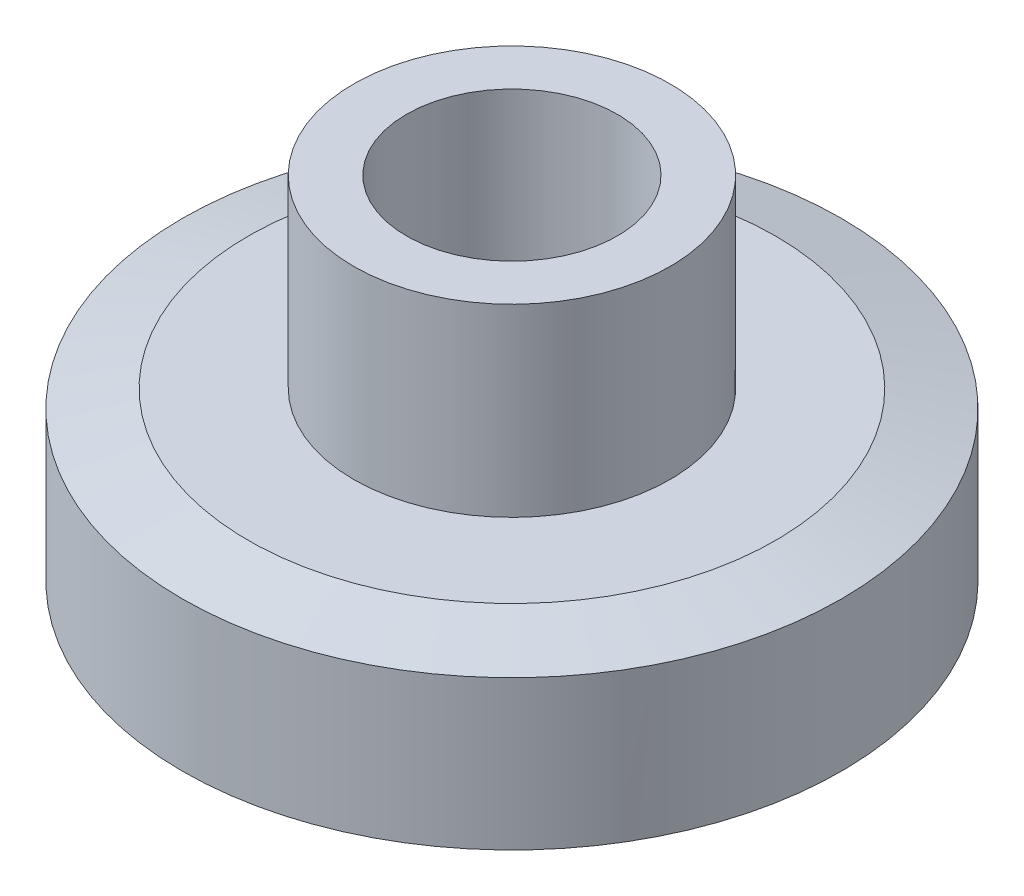
ISO-10303-21;
HEADER;
FILE_DESCRIPTION(('STEP AP214'),'2;1');
FILE_NAME('part.step','',(''),(''),'','','');
FILE_SCHEMA(('AUTOMOTIVE_DESIGN { 1 0 10303 214 1 1 1 1 }'));
ENDSEC;
DATA;
#1=APPLICATION_CONTEXT('core data for automotive mechanical design processes');
#2=APPLICATION_PROTOCOL_DEFINITION('international standard','automotive_design',2000,#1);
#3=PRODUCT_CONTEXT('',#1,'mechanical');
#4=PRODUCT('Part','Part','',(#3));
#5=PRODUCT_RELATED_PRODUCT_CATEGORY('part','',(#4));
#6=PRODUCT_DEFINITION_FORMATION('','',#4);
#7=PRODUCT_DEFINITION_CONTEXT('part definition',#1,'design');
#8=PRODUCT_DEFINITION('design','',#6,#7);
#9=PRODUCT_DEFINITION_SHAPE('','',#8);
#10=(LENGTH_UNIT() NAMED_UNIT(*) SI_UNIT(.MILLI.,.METRE.));
#11=(NAMED_UNIT(*) PLANE_ANGLE_UNIT() SI_UNIT($,.RADIAN.));
#12=(NAMED_UNIT(*) SI_UNIT($,.STERADIAN.) SOLID_ANGLE_UNIT());
#13=UNCERTAINTY_MEASURE_WITH_UNIT(LENGTH_MEASURE(1.E-05),#10,'distance_accuracy_value','');
#14=(GEOMETRIC_REPRESENTATION_CONTEXT(3) GLOBAL_UNCERTAINTY_ASSIGNED_CONTEXT((#13)) GLOBAL_UNIT_ASSIGNED_CONTEXT((#10,
#11,#12)) REPRESENTATION_CONTEXT('',''));
#15=CARTESIAN_POINT('',(0.,0.,0.));
#16=DIRECTION('',(0.,0.,1.));
#17=DIRECTION('',(1.,0.,0.));
#18=AXIS2_PLACEMENT_3D('',#15,#16,#17);
#19=CARTESIAN_POINT('',(0.,0.,0.));
#20=DIRECTION('',(0.,1.,0.));
#21=DIRECTION('',(0.,0.,1.));
#22=AXIS2_PLACEMENT_3D('',#19,#20,#21);
#23=PLANE('',#22);
#24=CARTESIAN_POINT('',(0.,0.,0.));
#25=DIRECTION('',(0.,1.,0.));
#26=DIRECTION('',(-1.,0.,0.));
#27=AXIS2_PLACEMENT_3D('',#24,#25,#26);
#28=CIRCLE('',#27,2.);
#29=CARTESIAN_POINT('',(-2.,0.,0.));
#30=VERTEX_POINT('',#29);
#31=EDGE_CURVE('E72',#30,#30,#28,.T.);
#32=ORIENTED_EDGE('',*,*,#31,.T.);
#33=EDGE_LOOP('',(#32));
#34=FACE_BOUND('',#33,.T.);
#35=CARTESIAN_POINT('',(0.,0.,0.));
#36=DIRECTION('',(0.,1.,0.));
#37=DIRECTION('',(0.,0.,1.));
#38=AXIS2_PLACEMENT_3D('',#35,#36,#37);
#39=CIRCLE('',#38,4.99999999999998);
#40=CARTESIAN_POINT('',(0.,0.,4.99999999999998));
#41=VERTEX_POINT('',#40);
#42=EDGE_CURVE('E10',#41,#41,#39,.F.);
#43=ORIENTED_EDGE('',*,*,#42,.T.);
#44=EDGE_LOOP('',(#43));
#45=FACE_BOUND('',#44,.T.);
#46=ADVANCED_FACE('F39',(#34,#45),#23,.F.);
#47=CARTESIAN_POINT('',(0.,7.,0.));
#48=DIRECTION('',(0.,1.,0.));
#49=DIRECTION('',(0.,0.,1.));
#50=AXIS2_PLACEMENT_3D('',#47,#48,#49);
#51=CYLINDRICAL_SURFACE('',#50,6.25);
#52=CARTESIAN_POINT('',(0.,0.334936490538904,0.));
#53=DIRECTION('',(0.,1.,0.));
#54=DIRECTION('',(0.,0.,1.));
#55=AXIS2_PLACEMENT_3D('',#52,#53,#54);
#56=CIRCLE('',#55,6.25);
#57=CARTESIAN_POINT('',(0.,0.334936490538904,6.25));
#58=VERTEX_POINT('',#57);
#59=EDGE_CURVE('E48',#58,#58,#56,.T.);
#60=ORIENTED_EDGE('',*,*,#59,.T.);
#61=EDGE_LOOP('',(#60));
#62=FACE_BOUND('',#61,.T.);
#63=CARTESIAN_POINT('',(0.,3.1650635094611,0.));
#64=DIRECTION('',(0.,-1.,0.));
#65=DIRECTION('',(0.,0.,-1.));
#66=AXIS2_PLACEMENT_3D('',#63,#64,#65);
#67=CIRCLE('',#66,6.25);
#68=CARTESIAN_POINT('',(0.,3.1650635094611,-6.25));
#69=VERTEX_POINT('',#68);
#70=EDGE_CURVE('E53',#69,#69,#67,.T.);
#71=ORIENTED_EDGE('',*,*,#70,.T.);
#72=EDGE_LOOP('',(#71));
#73=FACE_BOUND('',#72,.T.);
#74=ADVANCED_FACE('F103',(#62,#73),#51,.T.);
#75=CARTESIAN_POINT('',(6.25,3.5,0.));
#76=DIRECTION('',(0.,-1.,0.));
#77=DIRECTION('',(0.,0.,-1.));
#78=AXIS2_PLACEMENT_3D('',#75,#76,#77);
#79=PLANE('',#78);
#80=CARTESIAN_POINT('',(0.,3.5,0.));
#81=DIRECTION('',(0.,-1.,0.));
#82=DIRECTION('',(0.,0.,-1.));
#83=AXIS2_PLACEMENT_3D('',#80,#81,#82);
#84=CIRCLE('',#83,4.99999999999999);
#85=CARTESIAN_POINT('',(0.,3.5,-4.99999999999999));
#86=VERTEX_POINT('',#85);
#87=EDGE_CURVE('E58',#86,#86,#84,.F.);
#88=ORIENTED_EDGE('',*,*,#87,.T.);
#89=EDGE_LOOP('',(#88));
#90=FACE_BOUND('',#89,.T.);
#91=CARTESIAN_POINT('',(0.,3.5,0.));
#92=DIRECTION('',(0.,1.,0.));
#93=DIRECTION('',(0.,0.,1.));
#94=AXIS2_PLACEMENT_3D('',#91,#92,#93);
#95=CIRCLE('',#94,3.);
#96=CARTESIAN_POINT('',(0.,3.5,3.));
#97=VERTEX_POINT('',#96);
#98=EDGE_CURVE('E64',#97,#97,#95,.T.);
#99=ORIENTED_EDGE('',*,*,#98,.F.);
#100=EDGE_LOOP('',(#99));
#101=FACE_BOUND('',#100,.T.);
#102=ADVANCED_FACE('F98',(#90,#101),#79,.F.);
#103=CARTESIAN_POINT('',(0.,7.,0.));
#104=DIRECTION('',(0.,1.,0.));
#105=DIRECTION('',(0.,0.,1.));
#106=AXIS2_PLACEMENT_3D('',#103,#104,#105);
#107=CYLINDRICAL_SURFACE('',#106,3.);
#108=CARTESIAN_POINT('',(0.,7.,0.));
#109=DIRECTION('',(0.,1.,0.));
#110=DIRECTION('',(0.,0.,1.));
#111=AXIS2_PLACEMENT_3D('',#108,#109,#110);
#112=CIRCLE('',#111,3.);
#113=CARTESIAN_POINT('',(0.,7.,3.));
#114=VERTEX_POINT('',#113);
#115=EDGE_CURVE('E68',#114,#114,#112,.T.);
#116=ORIENTED_EDGE('',*,*,#115,.F.);
#117=EDGE_LOOP('',(#116));
#118=FACE_BOUND('',#117,.T.);
#119=ORIENTED_EDGE('',*,*,#98,.T.);
#120=EDGE_LOOP('',(#119));
#121=FACE_BOUND('',#120,.T.);
#122=ADVANCED_FACE('F92',(#118,#121),#107,.T.);
#123=CARTESIAN_POINT('',(3.,7.,0.));
#124=DIRECTION('',(0.,-1.,0.));
#125=DIRECTION('',(0.,0.,-1.));
#126=AXIS2_PLACEMENT_3D('',#123,#124,#125);
#127=PLANE('',#126);
#128=CARTESIAN_POINT('',(0.,7.,0.));
#129=DIRECTION('',(0.,1.,0.));
#130=DIRECTION('',(-1.,0.,0.));
#131=AXIS2_PLACEMENT_3D('',#128,#129,#130);
#132=CIRCLE('',#131,2.);
#133=CARTESIAN_POINT('',(-2.,7.,0.));
#134=VERTEX_POINT('',#133);
#135=EDGE_CURVE('E73',#134,#134,#132,.T.);
#136=ORIENTED_EDGE('',*,*,#135,.F.);
#137=EDGE_LOOP('',(#136));
#138=FACE_BOUND('',#137,.T.);
#139=ORIENTED_EDGE('',*,*,#115,.T.);
#140=EDGE_LOOP('',(#139));
#141=FACE_BOUND('',#140,.T.);
#142=ADVANCED_FACE('F88',(#138,#141),#127,.F.);
#143=CARTESIAN_POINT('',(0.,3.5,0.));
#144=DIRECTION('',(0.,-1.,0.));
#145=DIRECTION('',(0.,0.,-1.));
#146=AXIS2_PLACEMENT_3D('',#143,#144,#145);
#147=CONICAL_SURFACE('',#146,4.99999999999999,1.30899693899575);
#148=ORIENTED_EDGE('',*,*,#70,.F.);
#149=EDGE_LOOP('',(#148));
#150=FACE_BOUND('',#149,.T.);
#151=ORIENTED_EDGE('',*,*,#87,.F.);
#152=EDGE_LOOP('',(#151));
#153=FACE_BOUND('',#152,.T.);
#154=ADVANCED_FACE('F91',(#150,#153),#147,.T.);
#155=CARTESIAN_POINT('',(0.,0.334936490538904,0.));
#156=DIRECTION('',(0.,1.,0.));
#157=DIRECTION('',(0.,0.,1.));
#158=AXIS2_PLACEMENT_3D('',#155,#156,#157);
#159=CONICAL_SURFACE('',#158,6.25,1.30899693899575);
#160=ORIENTED_EDGE('',*,*,#42,.F.);
#161=EDGE_LOOP('',(#160));
#162=FACE_BOUND('',#161,.T.);
#163=ORIENTED_EDGE('',*,*,#59,.F.);
#164=EDGE_LOOP('',(#163));
#165=FACE_BOUND('',#164,.T.);
#166=ADVANCED_FACE('F42',(#162,#165),#159,.T.);
#167=CARTESIAN_POINT('',(0.,0.,0.));
#168=DIRECTION('',(0.,1.,0.));
#169=DIRECTION('',(-1.,0.,0.));
#170=AXIS2_PLACEMENT_3D('',#167,#168,#169);
#171=CYLINDRICAL_SURFACE('',#170,2.);
#172=ORIENTED_EDGE('',*,*,#31,.F.);
#173=EDGE_LOOP('',(#172));
#174=FACE_BOUND('',#173,.T.);
#175=ORIENTED_EDGE('',*,*,#135,.T.);
#176=EDGE_LOOP('',(#175));
#177=FACE_BOUND('',#176,.T.);
#178=ADVANCED_FACE('F82',(#174,#177),#171,.F.);
#179=CLOSED_SHELL('',(#46,#74,#102,#122,#142,#154,#166,#178));
#180=MANIFOLD_SOLID_BREP('B2',#179);
#181=ADVANCED_BREP_SHAPE_REPRESENTATION('',(#18,#180),#14);
#182=SHAPE_DEFINITION_REPRESENTATION(#9,#181);
ENDSEC;
END-ISO-10303-21;
